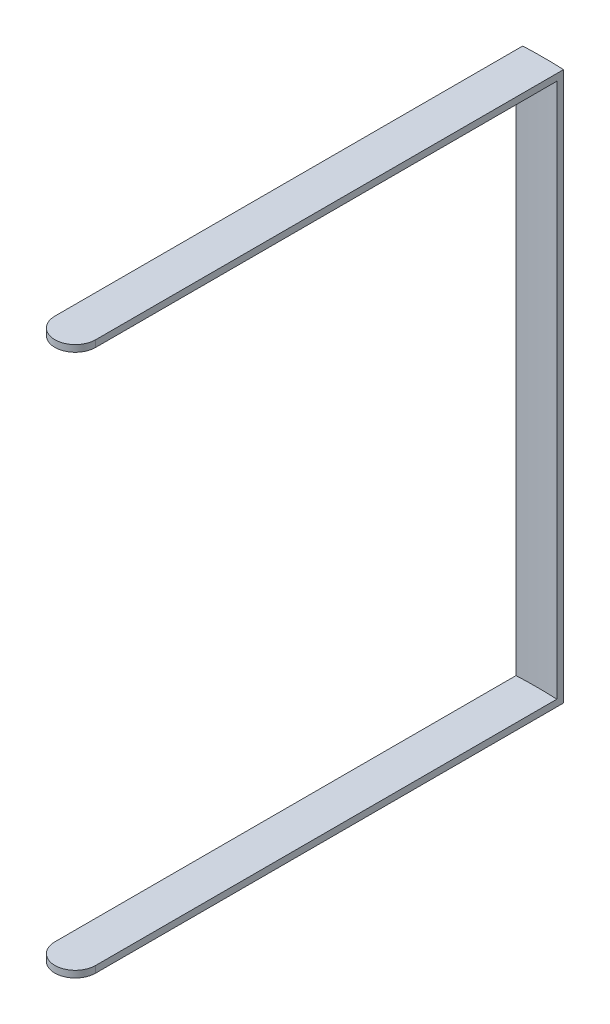
ISO-10303-21;
HEADER;
FILE_DESCRIPTION(('STEP AP214'),'2;1');
FILE_NAME('part.step','',(''),(''),'','','');
FILE_SCHEMA(('AUTOMOTIVE_DESIGN { 1 0 10303 214 1 1 1 1 }'));
ENDSEC;
DATA;
#1=APPLICATION_CONTEXT('core data for automotive mechanical design processes');
#2=APPLICATION_PROTOCOL_DEFINITION('international standard','automotive_design',2000,#1);
#3=PRODUCT_CONTEXT('',#1,'mechanical');
#4=PRODUCT('Part','Part','',(#3));
#5=PRODUCT_RELATED_PRODUCT_CATEGORY('part','',(#4));
#6=PRODUCT_DEFINITION_FORMATION('','',#4);
#7=PRODUCT_DEFINITION_CONTEXT('part definition',#1,'design');
#8=PRODUCT_DEFINITION('design','',#6,#7);
#9=PRODUCT_DEFINITION_SHAPE('','',#8);
#10=(LENGTH_UNIT() NAMED_UNIT(*) SI_UNIT(.MILLI.,.METRE.));
#11=(NAMED_UNIT(*) PLANE_ANGLE_UNIT() SI_UNIT($,.RADIAN.));
#12=(NAMED_UNIT(*) SI_UNIT($,.STERADIAN.) SOLID_ANGLE_UNIT());
#13=UNCERTAINTY_MEASURE_WITH_UNIT(LENGTH_MEASURE(1.E-05),#10,'distance_accuracy_value','');
#14=(GEOMETRIC_REPRESENTATION_CONTEXT(3) GLOBAL_UNCERTAINTY_ASSIGNED_CONTEXT((#13)) GLOBAL_UNIT_ASSIGNED_CONTEXT((#10,
#11,#12)) REPRESENTATION_CONTEXT('',''));
#15=CARTESIAN_POINT('',(0.,0.,0.));
#16=DIRECTION('',(0.,0.,1.));
#17=DIRECTION('',(1.,0.,0.));
#18=AXIS2_PLACEMENT_3D('',#15,#16,#17);
#19=CARTESIAN_POINT('',(0.,2.54,0.));
#20=DIRECTION('',(0.,-1.,0.));
#21=DIRECTION('',(0.,0.,-1.));
#22=AXIS2_PLACEMENT_3D('',#19,#20,#21);
#23=PLANE('',#22);
#24=CARTESIAN_POINT('',(0.,2.54,0.));
#25=DIRECTION('',(0.,-1.,0.));
#26=DIRECTION('',(0.,0.,-1.));
#27=AXIS2_PLACEMENT_3D('',#24,#25,#26);
#28=CIRCLE('',#27,175.262452536503);
#29=CARTESIAN_POINT('',(-7.75552707355612,2.54,-175.090773797254));
#30=VERTEX_POINT('',#29);
#31=CARTESIAN_POINT('',(7.75552707355609,2.54,-175.090773797254));
#32=VERTEX_POINT('',#31);
#33=EDGE_CURVE('E61',#30,#32,#28,.T.);
#34=ORIENTED_EDGE('',*,*,#33,.F.);
#35=DIRECTION('',(0.,0.,1.));
#36=VECTOR('',#35,1.);
#37=CARTESIAN_POINT('',(-7.75552707355612,2.54,0.));
#38=LINE('',#37,#36);
#39=CARTESIAN_POINT('',(-7.75552707355612,2.54,0.));
#40=VERTEX_POINT('',#39);
#41=EDGE_CURVE('E66',#30,#40,#38,.T.);
#42=ORIENTED_EDGE('',*,*,#41,.T.);
#43=CARTESIAN_POINT('',(0.,2.54,0.));
#44=DIRECTION('',(0.,1.,0.));
#45=DIRECTION('',(0.,0.,-1.));
#46=AXIS2_PLACEMENT_3D('',#43,#44,#45);
#47=CIRCLE('',#46,7.75552707355612);
#48=CARTESIAN_POINT('',(7.75552707355612,2.54,0.));
#49=VERTEX_POINT('',#48);
#50=EDGE_CURVE('E98',#40,#49,#47,.T.);
#51=ORIENTED_EDGE('',*,*,#50,.T.);
#52=DIRECTION('',(0.,0.,-1.));
#53=VECTOR('',#52,1.);
#54=CARTESIAN_POINT('',(7.75552707355612,2.54,0.));
#55=LINE('',#54,#53);
#56=EDGE_CURVE('E188',#49,#32,#55,.T.);
#57=ORIENTED_EDGE('',*,*,#56,.T.);
#58=EDGE_LOOP('',(#34,#42,#51,#57));
#59=FACE_BOUND('',#58,.T.);
#60=ADVANCED_FACE('F45',(#59),#23,.F.);
#61=CARTESIAN_POINT('',(0.,2.54,0.));
#62=DIRECTION('',(0.,-1.,0.));
#63=DIRECTION('',(0.,0.,-1.));
#64=AXIS2_PLACEMENT_3D('',#61,#62,#63);
#65=CYLINDRICAL_SURFACE('',#64,7.75552707355612);
#66=CARTESIAN_POINT('',(0.,0.,0.));
#67=DIRECTION('',(0.,1.,0.));
#68=DIRECTION('',(0.,0.,-1.));
#69=AXIS2_PLACEMENT_3D('',#66,#67,#68);
#70=CIRCLE('',#69,7.75552707355612);
#71=CARTESIAN_POINT('',(-7.75552707355612,0.,0.));
#72=VERTEX_POINT('',#71);
#73=CARTESIAN_POINT('',(7.75552707355612,0.,0.));
#74=VERTEX_POINT('',#73);
#75=EDGE_CURVE('E104',#72,#74,#70,.T.);
#76=ORIENTED_EDGE('',*,*,#75,.T.);
#77=DIRECTION('',(0.,-1.,0.));
#78=VECTOR('',#77,1.);
#79=CARTESIAN_POINT('',(7.75552707355612,2.54,0.));
#80=LINE('',#79,#78);
#81=EDGE_CURVE('E11',#49,#74,#80,.T.);
#82=ORIENTED_EDGE('',*,*,#81,.F.);
#83=ORIENTED_EDGE('',*,*,#50,.F.);
#84=DIRECTION('',(0.,-1.,0.));
#85=VECTOR('',#84,1.);
#86=CARTESIAN_POINT('',(-7.75552707355612,2.54,0.));
#87=LINE('',#86,#85);
#88=EDGE_CURVE('E89',#40,#72,#87,.T.);
#89=ORIENTED_EDGE('',*,*,#88,.T.);
#90=EDGE_LOOP('',(#76,#82,#83,#89));
#91=FACE_BOUND('',#90,.T.);
#92=ADVANCED_FACE('F47',(#91),#65,.T.);
#93=CARTESIAN_POINT('',(7.75552707355612,2.54,0.));
#94=DIRECTION('',(-1.,0.,0.));
#95=DIRECTION('',(0.,0.,1.));
#96=AXIS2_PLACEMENT_3D('',#93,#94,#95);
#97=PLANE('',#96);
#98=DIRECTION('',(0.,0.,-1.));
#99=VECTOR('',#98,1.);
#100=CARTESIAN_POINT('',(7.75552707355612,0.,0.));
#101=LINE('',#100,#99);
#102=CARTESIAN_POINT('',(7.75552707355612,0.,-177.630773797254));
#103=VERTEX_POINT('',#102);
#104=EDGE_CURVE('E108',#74,#103,#101,.T.);
#105=ORIENTED_EDGE('',*,*,#104,.T.);
#106=DIRECTION('',(0.,-1.,0.));
#107=VECTOR('',#106,1.);
#108=CARTESIAN_POINT('',(7.75552707355612,2.54,-177.630773797254));
#109=LINE('',#108,#107);
#110=CARTESIAN_POINT('',(7.75552707355614,208.28,-177.630773797254));
#111=VERTEX_POINT('',#110);
#112=EDGE_CURVE('E54',#111,#103,#109,.T.);
#113=ORIENTED_EDGE('',*,*,#112,.F.);
#114=DIRECTION('',(0.,0.,-1.));
#115=VECTOR('',#114,1.);
#116=CARTESIAN_POINT('',(7.75552707355614,208.28,0.));
#117=LINE('',#116,#115);
#118=CARTESIAN_POINT('',(7.75552707355614,208.28,0.));
#119=VERTEX_POINT('',#118);
#120=EDGE_CURVE('E139',#119,#111,#117,.T.);
#121=ORIENTED_EDGE('',*,*,#120,.F.);
#122=DIRECTION('',(0.,-1.,0.));
#123=VECTOR('',#122,1.);
#124=CARTESIAN_POINT('',(7.75552707355614,208.28,0.));
#125=LINE('',#124,#123);
#126=CARTESIAN_POINT('',(7.75552707355614,205.74,0.));
#127=VERTEX_POINT('',#126);
#128=EDGE_CURVE('E175',#119,#127,#125,.T.);
#129=ORIENTED_EDGE('',*,*,#128,.T.);
#130=DIRECTION('',(0.,0.,-1.));
#131=VECTOR('',#130,1.);
#132=CARTESIAN_POINT('',(7.75552707355614,205.74,0.));
#133=LINE('',#132,#131);
#134=CARTESIAN_POINT('',(7.75552707355614,205.74,-175.090773797254));
#135=VERTEX_POINT('',#134);
#136=EDGE_CURVE('E165',#127,#135,#133,.T.);
#137=ORIENTED_EDGE('',*,*,#136,.T.);
#138=DIRECTION('',(0.,-1.,0.));
#139=VECTOR('',#138,1.);
#140=CARTESIAN_POINT('',(7.75552707355609,205.74,-175.090773797254));
#141=LINE('',#140,#139);
#142=EDGE_CURVE('E116',#135,#32,#141,.T.);
#143=ORIENTED_EDGE('',*,*,#142,.T.);
#144=ORIENTED_EDGE('',*,*,#56,.F.);
#145=ORIENTED_EDGE('',*,*,#81,.T.);
#146=EDGE_LOOP('',(#105,#113,#121,#129,#137,#143,#144,#145));
#147=FACE_BOUND('',#146,.T.);
#148=ADVANCED_FACE('F136',(#147),#97,.F.);
#149=CARTESIAN_POINT('',(0.,2.54,0.));
#150=DIRECTION('',(0.,-1.,0.));
#151=DIRECTION('',(0.,0.,-1.));
#152=AXIS2_PLACEMENT_3D('',#149,#150,#151);
#153=CYLINDRICAL_SURFACE('',#152,177.8);
#154=CARTESIAN_POINT('',(0.,0.,0.));
#155=DIRECTION('',(0.,1.,0.));
#156=DIRECTION('',(0.,0.,-1.));
#157=AXIS2_PLACEMENT_3D('',#154,#155,#156);
#158=CIRCLE('',#157,177.8);
#159=CARTESIAN_POINT('',(-7.75552707355614,0.,-177.630773797254));
#160=VERTEX_POINT('',#159);
#161=EDGE_CURVE('E99',#103,#160,#158,.T.);
#162=ORIENTED_EDGE('',*,*,#161,.T.);
#163=DIRECTION('',(0.,-1.,0.));
#164=VECTOR('',#163,1.);
#165=CARTESIAN_POINT('',(-7.75552707355614,2.54,-177.630773797254));
#166=LINE('',#165,#164);
#167=CARTESIAN_POINT('',(-7.75552707355614,208.28,-177.630773797254));
#168=VERTEX_POINT('',#167);
#169=EDGE_CURVE('E93',#168,#160,#166,.T.);
#170=ORIENTED_EDGE('',*,*,#169,.F.);
#171=CARTESIAN_POINT('',(0.,208.28,0.));
#172=DIRECTION('',(0.,1.,0.));
#173=DIRECTION('',(0.,0.,-1.));
#174=AXIS2_PLACEMENT_3D('',#171,#172,#173);
#175=CIRCLE('',#174,177.8);
#176=EDGE_CURVE('E132',#111,#168,#175,.T.);
#177=ORIENTED_EDGE('',*,*,#176,.F.);
#178=ORIENTED_EDGE('',*,*,#112,.T.);
#179=EDGE_LOOP('',(#162,#170,#177,#178));
#180=FACE_BOUND('',#179,.T.);
#181=ADVANCED_FACE('F129',(#180),#153,.T.);
#182=CARTESIAN_POINT('',(-7.75552707355612,2.54,0.));
#183=DIRECTION('',(1.,0.,0.));
#184=DIRECTION('',(0.,0.,-1.));
#185=AXIS2_PLACEMENT_3D('',#182,#183,#184);
#186=PLANE('',#185);
#187=DIRECTION('',(0.,0.,1.));
#188=VECTOR('',#187,1.);
#189=CARTESIAN_POINT('',(-7.75552707355612,0.,0.));
#190=LINE('',#189,#188);
#191=EDGE_CURVE('E86',#160,#72,#190,.T.);
#192=ORIENTED_EDGE('',*,*,#191,.T.);
#193=ORIENTED_EDGE('',*,*,#88,.F.);
#194=ORIENTED_EDGE('',*,*,#41,.F.);
#195=DIRECTION('',(0.,-1.,0.));
#196=VECTOR('',#195,1.);
#197=CARTESIAN_POINT('',(-7.75552707355614,205.74,-175.090773797254));
#198=LINE('',#197,#196);
#199=CARTESIAN_POINT('',(-7.75552707355614,205.74,-175.090773797254));
#200=VERTEX_POINT('',#199);
#201=EDGE_CURVE('E110',#200,#30,#198,.T.);
#202=ORIENTED_EDGE('',*,*,#201,.F.);
#203=DIRECTION('',(0.,0.,1.));
#204=VECTOR('',#203,1.);
#205=CARTESIAN_POINT('',(-7.75552707355614,205.74,0.));
#206=LINE('',#205,#204);
#207=CARTESIAN_POINT('',(-7.75552707355614,205.74,0.));
#208=VERTEX_POINT('',#207);
#209=EDGE_CURVE('E155',#200,#208,#206,.T.);
#210=ORIENTED_EDGE('',*,*,#209,.T.);
#211=DIRECTION('',(0.,-1.,0.));
#212=VECTOR('',#211,1.);
#213=CARTESIAN_POINT('',(-7.75552707355614,208.28,0.));
#214=LINE('',#213,#212);
#215=CARTESIAN_POINT('',(-7.75552707355614,208.28,0.));
#216=VERTEX_POINT('',#215);
#217=EDGE_CURVE('E160',#216,#208,#214,.T.);
#218=ORIENTED_EDGE('',*,*,#217,.F.);
#219=DIRECTION('',(0.,0.,1.));
#220=VECTOR('',#219,1.);
#221=CARTESIAN_POINT('',(-7.75552707355614,208.28,0.));
#222=LINE('',#221,#220);
#223=EDGE_CURVE('E153',#168,#216,#222,.T.);
#224=ORIENTED_EDGE('',*,*,#223,.F.);
#225=ORIENTED_EDGE('',*,*,#169,.T.);
#226=EDGE_LOOP('',(#192,#193,#194,#202,#210,#218,#224,#225));
#227=FACE_BOUND('',#226,.T.);
#228=ADVANCED_FACE('F88',(#227),#186,.F.);
#229=CARTESIAN_POINT('',(0.,0.,0.));
#230=DIRECTION('',(0.,-1.,0.));
#231=DIRECTION('',(0.,0.,-1.));
#232=AXIS2_PLACEMENT_3D('',#229,#230,#231);
#233=PLANE('',#232);
#234=ORIENTED_EDGE('',*,*,#75,.F.);
#235=ORIENTED_EDGE('',*,*,#191,.F.);
#236=ORIENTED_EDGE('',*,*,#161,.F.);
#237=ORIENTED_EDGE('',*,*,#104,.F.);
#238=EDGE_LOOP('',(#234,#235,#236,#237));
#239=FACE_BOUND('',#238,.T.);
#240=ADVANCED_FACE('F107',(#239),#233,.T.);
#241=CARTESIAN_POINT('',(0.,205.74,0.));
#242=DIRECTION('',(0.,-1.,0.));
#243=DIRECTION('',(0.,0.,-1.));
#244=AXIS2_PLACEMENT_3D('',#241,#242,#243);
#245=CYLINDRICAL_SURFACE('',#244,175.262452536503);
#246=ORIENTED_EDGE('',*,*,#33,.T.);
#247=ORIENTED_EDGE('',*,*,#142,.F.);
#248=CARTESIAN_POINT('',(0.,205.74,0.));
#249=DIRECTION('',(0.,-1.,0.));
#250=DIRECTION('',(0.,0.,-1.));
#251=AXIS2_PLACEMENT_3D('',#248,#249,#250);
#252=CIRCLE('',#251,175.262452536503);
#253=EDGE_CURVE('E178',#200,#135,#252,.T.);
#254=ORIENTED_EDGE('',*,*,#253,.F.);
#255=ORIENTED_EDGE('',*,*,#201,.T.);
#256=EDGE_LOOP('',(#246,#247,#254,#255));
#257=FACE_BOUND('',#256,.T.);
#258=ADVANCED_FACE('F195',(#257),#245,.F.);
#259=CARTESIAN_POINT('',(0.,205.74,0.));
#260=DIRECTION('',(0.,-1.,0.));
#261=DIRECTION('',(0.,0.,-1.));
#262=AXIS2_PLACEMENT_3D('',#259,#260,#261);
#263=PLANE('',#262);
#264=ORIENTED_EDGE('',*,*,#209,.F.);
#265=ORIENTED_EDGE('',*,*,#253,.T.);
#266=ORIENTED_EDGE('',*,*,#136,.F.);
#267=CARTESIAN_POINT('',(0.,205.74,0.));
#268=DIRECTION('',(0.,1.,0.));
#269=DIRECTION('',(0.,0.,-1.));
#270=AXIS2_PLACEMENT_3D('',#267,#268,#269);
#271=CIRCLE('',#270,7.75552707355614);
#272=EDGE_CURVE('E161',#208,#127,#271,.T.);
#273=ORIENTED_EDGE('',*,*,#272,.F.);
#274=EDGE_LOOP('',(#264,#265,#266,#273));
#275=FACE_BOUND('',#274,.T.);
#276=ADVANCED_FACE('F205',(#275),#263,.T.);
#277=CARTESIAN_POINT('',(0.,208.28,0.));
#278=DIRECTION('',(0.,-1.,0.));
#279=DIRECTION('',(0.,0.,-1.));
#280=AXIS2_PLACEMENT_3D('',#277,#278,#279);
#281=CYLINDRICAL_SURFACE('',#280,7.75552707355614);
#282=ORIENTED_EDGE('',*,*,#272,.T.);
#283=ORIENTED_EDGE('',*,*,#128,.F.);
#284=CARTESIAN_POINT('',(0.,208.28,0.));
#285=DIRECTION('',(0.,1.,0.));
#286=DIRECTION('',(0.,0.,-1.));
#287=AXIS2_PLACEMENT_3D('',#284,#285,#286);
#288=CIRCLE('',#287,7.75552707355614);
#289=EDGE_CURVE('E147',#216,#119,#288,.T.);
#290=ORIENTED_EDGE('',*,*,#289,.F.);
#291=ORIENTED_EDGE('',*,*,#217,.T.);
#292=EDGE_LOOP('',(#282,#283,#290,#291));
#293=FACE_BOUND('',#292,.T.);
#294=ADVANCED_FACE('F214',(#293),#281,.T.);
#295=CARTESIAN_POINT('',(0.,208.28,0.));
#296=DIRECTION('',(0.,-1.,0.));
#297=DIRECTION('',(0.,0.,-1.));
#298=AXIS2_PLACEMENT_3D('',#295,#296,#297);
#299=PLANE('',#298);
#300=ORIENTED_EDGE('',*,*,#289,.T.);
#301=ORIENTED_EDGE('',*,*,#120,.T.);
#302=ORIENTED_EDGE('',*,*,#176,.T.);
#303=ORIENTED_EDGE('',*,*,#223,.T.);
#304=EDGE_LOOP('',(#300,#301,#302,#303));
#305=FACE_BOUND('',#304,.T.);
#306=ADVANCED_FACE('F144',(#305),#299,.F.);
#307=CLOSED_SHELL('',(#60,#92,#148,#181,#228,#240,#258,#276,#294,#306));
#308=MANIFOLD_SOLID_BREP('B2',#307);
#309=ADVANCED_BREP_SHAPE_REPRESENTATION('',(#18,#308),#14);
#310=SHAPE_DEFINITION_REPRESENTATION(#9,#309);
ENDSEC;
END-ISO-10303-21;
